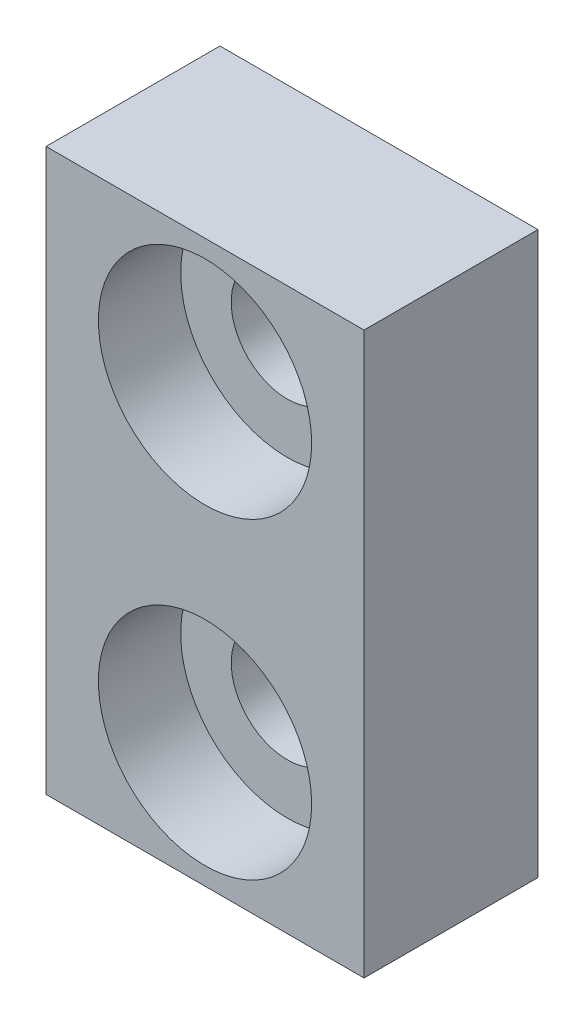
ISO-10303-21;
HEADER;
FILE_DESCRIPTION(('STEP AP214'),'2;1');
FILE_NAME('part.step','',(''),(''),'','','');
FILE_SCHEMA(('AUTOMOTIVE_DESIGN { 1 0 10303 214 1 1 1 1 }'));
ENDSEC;
DATA;
#1=APPLICATION_CONTEXT('core data for automotive mechanical design processes');
#2=APPLICATION_PROTOCOL_DEFINITION('international standard','automotive_design',2000,#1);
#3=PRODUCT_CONTEXT('',#1,'mechanical');
#4=PRODUCT('Part','Part','',(#3));
#5=PRODUCT_RELATED_PRODUCT_CATEGORY('part','',(#4));
#6=PRODUCT_DEFINITION_FORMATION('','',#4);
#7=PRODUCT_DEFINITION_CONTEXT('part definition',#1,'design');
#8=PRODUCT_DEFINITION('design','',#6,#7);
#9=PRODUCT_DEFINITION_SHAPE('','',#8);
#10=(LENGTH_UNIT() NAMED_UNIT(*) SI_UNIT(.MILLI.,.METRE.));
#11=(NAMED_UNIT(*) PLANE_ANGLE_UNIT() SI_UNIT($,.RADIAN.));
#12=(NAMED_UNIT(*) SI_UNIT($,.STERADIAN.) SOLID_ANGLE_UNIT());
#13=UNCERTAINTY_MEASURE_WITH_UNIT(LENGTH_MEASURE(1.E-05),#10,'distance_accuracy_value','');
#14=(GEOMETRIC_REPRESENTATION_CONTEXT(3) GLOBAL_UNCERTAINTY_ASSIGNED_CONTEXT((#13)) GLOBAL_UNIT_ASSIGNED_CONTEXT((#10,
#11,#12)) REPRESENTATION_CONTEXT('',''));
#15=CARTESIAN_POINT('',(0.,0.,0.));
#16=DIRECTION('',(0.,0.,1.));
#17=DIRECTION('',(1.,0.,0.));
#18=AXIS2_PLACEMENT_3D('',#15,#16,#17);
#19=CARTESIAN_POINT('',(0.,-4.175,4.65));
#20=DIRECTION('',(0.,0.,1.));
#21=DIRECTION('',(1.,0.,0.));
#22=AXIS2_PLACEMENT_3D('',#19,#20,#21);
#23=CYLINDRICAL_SURFACE('',#22,1.49999999999999);
#24=CARTESIAN_POINT('',(0.,-4.175,0.));
#25=DIRECTION('',(0.,0.,-1.));
#26=DIRECTION('',(-1.,0.,0.));
#27=AXIS2_PLACEMENT_3D('',#24,#25,#26);
#28=CIRCLE('',#27,1.49999999999999);
#29=CARTESIAN_POINT('',(-1.49999999999999,-4.175,0.));
#30=VERTEX_POINT('',#29);
#31=EDGE_CURVE('E114',#30,#30,#28,.T.);
#32=ORIENTED_EDGE('',*,*,#31,.T.);
#33=EDGE_LOOP('',(#32));
#34=FACE_BOUND('',#33,.T.);
#35=CARTESIAN_POINT('',(0.,-4.175,2.45));
#36=DIRECTION('',(0.,0.,1.));
#37=DIRECTION('',(1.,0.,0.));
#38=AXIS2_PLACEMENT_3D('',#35,#36,#37);
#39=CIRCLE('',#38,1.49999999999999);
#40=CARTESIAN_POINT('',(1.49999999999999,-4.175,2.45));
#41=VERTEX_POINT('',#40);
#42=EDGE_CURVE('E42',#41,#41,#39,.F.);
#43=ORIENTED_EDGE('',*,*,#42,.F.);
#44=EDGE_LOOP('',(#43));
#45=FACE_BOUND('',#44,.T.);
#46=ADVANCED_FACE('F38',(#34,#45),#23,.F.);
#47=CARTESIAN_POINT('',(0.,4.175,4.65));
#48=DIRECTION('',(0.,0.,1.));
#49=DIRECTION('',(1.,0.,0.));
#50=AXIS2_PLACEMENT_3D('',#47,#48,#49);
#51=CYLINDRICAL_SURFACE('',#50,1.49999999999999);
#52=CARTESIAN_POINT('',(0.,4.175,0.));
#53=DIRECTION('',(0.,0.,-1.));
#54=DIRECTION('',(-1.,0.,0.));
#55=AXIS2_PLACEMENT_3D('',#52,#53,#54);
#56=CIRCLE('',#55,1.49999999999999);
#57=CARTESIAN_POINT('',(-1.49999999999999,4.175,0.));
#58=VERTEX_POINT('',#57);
#59=EDGE_CURVE('E128',#58,#58,#56,.T.);
#60=ORIENTED_EDGE('',*,*,#59,.T.);
#61=EDGE_LOOP('',(#60));
#62=FACE_BOUND('',#61,.T.);
#63=CARTESIAN_POINT('',(0.,4.175,2.45));
#64=DIRECTION('',(0.,0.,1.));
#65=DIRECTION('',(1.,0.,0.));
#66=AXIS2_PLACEMENT_3D('',#63,#64,#65);
#67=CIRCLE('',#66,1.49999999999999);
#68=CARTESIAN_POINT('',(1.49999999999999,4.175,2.45));
#69=VERTEX_POINT('',#68);
#70=EDGE_CURVE('E131',#69,#69,#67,.F.);
#71=ORIENTED_EDGE('',*,*,#70,.F.);
#72=EDGE_LOOP('',(#71));
#73=FACE_BOUND('',#72,.T.);
#74=ADVANCED_FACE('F186',(#62,#73),#51,.F.);
#75=CARTESIAN_POINT('',(4.25,-7.5,4.65));
#76=DIRECTION('',(-1.,0.,0.));
#77=DIRECTION('',(0.,0.,1.));
#78=AXIS2_PLACEMENT_3D('',#75,#76,#77);
#79=PLANE('',#78);
#80=DIRECTION('',(0.,1.,0.));
#81=VECTOR('',#80,1.);
#82=CARTESIAN_POINT('',(4.25,-7.5,0.));
#83=LINE('',#82,#81);
#84=CARTESIAN_POINT('',(4.25,-7.5,0.));
#85=VERTEX_POINT('',#84);
#86=CARTESIAN_POINT('',(4.25,7.5,0.));
#87=VERTEX_POINT('',#86);
#88=EDGE_CURVE('E110',#85,#87,#83,.T.);
#89=ORIENTED_EDGE('',*,*,#88,.T.);
#90=DIRECTION('',(0.,0.,-1.));
#91=VECTOR('',#90,1.);
#92=CARTESIAN_POINT('',(4.25,7.5,4.65));
#93=LINE('',#92,#91);
#94=CARTESIAN_POINT('',(4.25,7.5,4.65));
#95=VERTEX_POINT('',#94);
#96=EDGE_CURVE('E11',#95,#87,#93,.T.);
#97=ORIENTED_EDGE('',*,*,#96,.F.);
#98=DIRECTION('',(0.,1.,0.));
#99=VECTOR('',#98,1.);
#100=CARTESIAN_POINT('',(4.25,-7.5,4.65));
#101=LINE('',#100,#99);
#102=CARTESIAN_POINT('',(4.25,-7.5,4.65));
#103=VERTEX_POINT('',#102);
#104=EDGE_CURVE('E93',#103,#95,#101,.T.);
#105=ORIENTED_EDGE('',*,*,#104,.F.);
#106=DIRECTION('',(0.,0.,-1.));
#107=VECTOR('',#106,1.);
#108=CARTESIAN_POINT('',(4.25,-7.5,4.65));
#109=LINE('',#108,#107);
#110=EDGE_CURVE('E106',#103,#85,#109,.T.);
#111=ORIENTED_EDGE('',*,*,#110,.T.);
#112=EDGE_LOOP('',(#89,#97,#105,#111));
#113=FACE_BOUND('',#112,.T.);
#114=ADVANCED_FACE('F40',(#113),#79,.F.);
#115=CARTESIAN_POINT('',(-4.25,7.5,4.65));
#116=DIRECTION('',(0.,-1.,0.));
#117=DIRECTION('',(0.,0.,-1.));
#118=AXIS2_PLACEMENT_3D('',#115,#116,#117);
#119=PLANE('',#118);
#120=DIRECTION('',(-1.,0.,0.));
#121=VECTOR('',#120,1.);
#122=CARTESIAN_POINT('',(-4.25,7.5,0.));
#123=LINE('',#122,#121);
#124=CARTESIAN_POINT('',(-4.25,7.5,0.));
#125=VERTEX_POINT('',#124);
#126=EDGE_CURVE('E98',#87,#125,#123,.T.);
#127=ORIENTED_EDGE('',*,*,#126,.T.);
#128=DIRECTION('',(0.,0.,-1.));
#129=VECTOR('',#128,1.);
#130=CARTESIAN_POINT('',(-4.25,7.5,4.65));
#131=LINE('',#130,#129);
#132=CARTESIAN_POINT('',(-4.25,7.5,4.65));
#133=VERTEX_POINT('',#132);
#134=EDGE_CURVE('E49',#133,#125,#131,.T.);
#135=ORIENTED_EDGE('',*,*,#134,.F.);
#136=DIRECTION('',(-1.,0.,0.));
#137=VECTOR('',#136,1.);
#138=CARTESIAN_POINT('',(-4.25,7.5,4.65));
#139=LINE('',#138,#137);
#140=EDGE_CURVE('E88',#95,#133,#139,.T.);
#141=ORIENTED_EDGE('',*,*,#140,.F.);
#142=ORIENTED_EDGE('',*,*,#96,.T.);
#143=EDGE_LOOP('',(#127,#135,#141,#142));
#144=FACE_BOUND('',#143,.T.);
#145=ADVANCED_FACE('F97',(#144),#119,.F.);
#146=CARTESIAN_POINT('',(-4.25,-7.5,4.65));
#147=DIRECTION('',(1.,0.,0.));
#148=DIRECTION('',(0.,0.,-1.));
#149=AXIS2_PLACEMENT_3D('',#146,#147,#148);
#150=PLANE('',#149);
#151=DIRECTION('',(0.,-1.,0.));
#152=VECTOR('',#151,1.);
#153=CARTESIAN_POINT('',(-4.25,-7.5,0.));
#154=LINE('',#153,#152);
#155=CARTESIAN_POINT('',(-4.25,-7.5,0.));
#156=VERTEX_POINT('',#155);
#157=EDGE_CURVE('E75',#125,#156,#154,.T.);
#158=ORIENTED_EDGE('',*,*,#157,.T.);
#159=DIRECTION('',(0.,0.,-1.));
#160=VECTOR('',#159,1.);
#161=CARTESIAN_POINT('',(-4.25,-7.5,4.65));
#162=LINE('',#161,#160);
#163=CARTESIAN_POINT('',(-4.25,-7.5,4.65));
#164=VERTEX_POINT('',#163);
#165=EDGE_CURVE('E100',#164,#156,#162,.T.);
#166=ORIENTED_EDGE('',*,*,#165,.F.);
#167=DIRECTION('',(0.,-1.,0.));
#168=VECTOR('',#167,1.);
#169=CARTESIAN_POINT('',(-4.25,-7.5,4.65));
#170=LINE('',#169,#168);
#171=EDGE_CURVE('E91',#133,#164,#170,.T.);
#172=ORIENTED_EDGE('',*,*,#171,.F.);
#173=ORIENTED_EDGE('',*,*,#134,.T.);
#174=EDGE_LOOP('',(#158,#166,#172,#173));
#175=FACE_BOUND('',#174,.T.);
#176=ADVANCED_FACE('F102',(#175),#150,.F.);
#177=CARTESIAN_POINT('',(-4.25,-7.5,4.65));
#178=DIRECTION('',(0.,1.,0.));
#179=DIRECTION('',(0.,0.,1.));
#180=AXIS2_PLACEMENT_3D('',#177,#178,#179);
#181=PLANE('',#180);
#182=DIRECTION('',(1.,0.,0.));
#183=VECTOR('',#182,1.);
#184=CARTESIAN_POINT('',(-4.25,-7.5,0.));
#185=LINE('',#184,#183);
#186=EDGE_CURVE('E81',#156,#85,#185,.T.);
#187=ORIENTED_EDGE('',*,*,#186,.T.);
#188=ORIENTED_EDGE('',*,*,#110,.F.);
#189=DIRECTION('',(1.,0.,0.));
#190=VECTOR('',#189,1.);
#191=CARTESIAN_POINT('',(-4.25,-7.5,4.65));
#192=LINE('',#191,#190);
#193=EDGE_CURVE('E58',#164,#103,#192,.T.);
#194=ORIENTED_EDGE('',*,*,#193,.F.);
#195=ORIENTED_EDGE('',*,*,#165,.T.);
#196=EDGE_LOOP('',(#187,#188,#194,#195));
#197=FACE_BOUND('',#196,.T.);
#198=ADVANCED_FACE('F170',(#197),#181,.F.);
#199=CARTESIAN_POINT('',(0.,0.,4.65));
#200=DIRECTION('',(0.,0.,-1.));
#201=DIRECTION('',(-1.,0.,0.));
#202=AXIS2_PLACEMENT_3D('',#199,#200,#201);
#203=PLANE('',#202);
#204=CARTESIAN_POINT('',(0.,4.175,4.65));
#205=DIRECTION('',(0.,0.,1.));
#206=DIRECTION('',(1.,0.,0.));
#207=AXIS2_PLACEMENT_3D('',#204,#205,#206);
#208=CIRCLE('',#207,2.85);
#209=CARTESIAN_POINT('',(2.85,4.175,4.65));
#210=VERTEX_POINT('',#209);
#211=EDGE_CURVE('E141',#210,#210,#208,.T.);
#212=ORIENTED_EDGE('',*,*,#211,.F.);
#213=EDGE_LOOP('',(#212));
#214=FACE_BOUND('',#213,.T.);
#215=CARTESIAN_POINT('',(0.,-4.175,4.65));
#216=DIRECTION('',(0.,0.,1.));
#217=DIRECTION('',(1.,0.,0.));
#218=AXIS2_PLACEMENT_3D('',#215,#216,#217);
#219=CIRCLE('',#218,2.85);
#220=CARTESIAN_POINT('',(2.85,-4.175,4.65));
#221=VERTEX_POINT('',#220);
#222=EDGE_CURVE('E147',#221,#221,#219,.T.);
#223=ORIENTED_EDGE('',*,*,#222,.F.);
#224=EDGE_LOOP('',(#223));
#225=FACE_BOUND('',#224,.T.);
#226=ORIENTED_EDGE('',*,*,#104,.T.);
#227=ORIENTED_EDGE('',*,*,#140,.T.);
#228=ORIENTED_EDGE('',*,*,#171,.T.);
#229=ORIENTED_EDGE('',*,*,#193,.T.);
#230=EDGE_LOOP('',(#226,#227,#228,#229));
#231=FACE_BOUND('',#230,.T.);
#232=ADVANCED_FACE('F89',(#214,#225,#231),#203,.F.);
#233=CARTESIAN_POINT('',(0.,0.,0.));
#234=DIRECTION('',(0.,0.,-1.));
#235=DIRECTION('',(-1.,0.,0.));
#236=AXIS2_PLACEMENT_3D('',#233,#234,#235);
#237=PLANE('',#236);
#238=ORIENTED_EDGE('',*,*,#59,.F.);
#239=EDGE_LOOP('',(#238));
#240=FACE_BOUND('',#239,.T.);
#241=ORIENTED_EDGE('',*,*,#31,.F.);
#242=EDGE_LOOP('',(#241));
#243=FACE_BOUND('',#242,.T.);
#244=ORIENTED_EDGE('',*,*,#88,.F.);
#245=ORIENTED_EDGE('',*,*,#186,.F.);
#246=ORIENTED_EDGE('',*,*,#157,.F.);
#247=ORIENTED_EDGE('',*,*,#126,.F.);
#248=EDGE_LOOP('',(#244,#245,#246,#247));
#249=FACE_BOUND('',#248,.T.);
#250=ADVANCED_FACE('F169',(#240,#243,#249),#237,.T.);
#251=CARTESIAN_POINT('',(0.,4.175,2.45));
#252=DIRECTION('',(0.,0.,1.));
#253=DIRECTION('',(1.,0.,0.));
#254=AXIS2_PLACEMENT_3D('',#251,#252,#253);
#255=PLANE('',#254);
#256=CARTESIAN_POINT('',(0.,4.175,2.45));
#257=DIRECTION('',(0.,0.,1.));
#258=DIRECTION('',(1.,0.,0.));
#259=AXIS2_PLACEMENT_3D('',#256,#257,#258);
#260=CIRCLE('',#259,2.85);
#261=CARTESIAN_POINT('',(2.85,4.175,2.45));
#262=VERTEX_POINT('',#261);
#263=EDGE_CURVE('E134',#262,#262,#260,.T.);
#264=ORIENTED_EDGE('',*,*,#263,.T.);
#265=EDGE_LOOP('',(#264));
#266=FACE_BOUND('',#265,.T.);
#267=ORIENTED_EDGE('',*,*,#70,.T.);
#268=EDGE_LOOP('',(#267));
#269=FACE_BOUND('',#268,.T.);
#270=ADVANCED_FACE('F178',(#266,#269),#255,.T.);
#271=CARTESIAN_POINT('',(0.,4.175,2.45));
#272=DIRECTION('',(0.,0.,1.));
#273=DIRECTION('',(1.,0.,0.));
#274=AXIS2_PLACEMENT_3D('',#271,#272,#273);
#275=CYLINDRICAL_SURFACE('',#274,2.85);
#276=ORIENTED_EDGE('',*,*,#263,.F.);
#277=EDGE_LOOP('',(#276));
#278=FACE_BOUND('',#277,.T.);
#279=ORIENTED_EDGE('',*,*,#211,.T.);
#280=EDGE_LOOP('',(#279));
#281=FACE_BOUND('',#280,.T.);
#282=ADVANCED_FACE('F197',(#278,#281),#275,.F.);
#283=CARTESIAN_POINT('',(0.,-4.175,2.45));
#284=DIRECTION('',(0.,0.,1.));
#285=DIRECTION('',(1.,0.,0.));
#286=AXIS2_PLACEMENT_3D('',#283,#284,#285);
#287=PLANE('',#286);
#288=CARTESIAN_POINT('',(0.,-4.175,2.45));
#289=DIRECTION('',(0.,0.,1.));
#290=DIRECTION('',(1.,0.,0.));
#291=AXIS2_PLACEMENT_3D('',#288,#289,#290);
#292=CIRCLE('',#291,2.85);
#293=CARTESIAN_POINT('',(2.85,-4.175,2.45));
#294=VERTEX_POINT('',#293);
#295=EDGE_CURVE('E153',#294,#294,#292,.T.);
#296=ORIENTED_EDGE('',*,*,#295,.T.);
#297=EDGE_LOOP('',(#296));
#298=FACE_BOUND('',#297,.T.);
#299=ORIENTED_EDGE('',*,*,#42,.T.);
#300=EDGE_LOOP('',(#299));
#301=FACE_BOUND('',#300,.T.);
#302=ADVANCED_FACE('F159',(#298,#301),#287,.T.);
#303=CARTESIAN_POINT('',(0.,-4.175,2.45));
#304=DIRECTION('',(0.,0.,1.));
#305=DIRECTION('',(1.,0.,0.));
#306=AXIS2_PLACEMENT_3D('',#303,#304,#305);
#307=CYLINDRICAL_SURFACE('',#306,2.85);
#308=ORIENTED_EDGE('',*,*,#295,.F.);
#309=EDGE_LOOP('',(#308));
#310=FACE_BOUND('',#309,.T.);
#311=ORIENTED_EDGE('',*,*,#222,.T.);
#312=EDGE_LOOP('',(#311));
#313=FACE_BOUND('',#312,.T.);
#314=ADVANCED_FACE('F162',(#310,#313),#307,.F.);
#315=CLOSED_SHELL('',(#46,#74,#114,#145,#176,#198,#232,#250,#270,#282,#302,#314));
#316=MANIFOLD_SOLID_BREP('B2',#315);
#317=ADVANCED_BREP_SHAPE_REPRESENTATION('',(#18,#316),#14);
#318=SHAPE_DEFINITION_REPRESENTATION(#9,#317);
ENDSEC;
END-ISO-10303-21;
